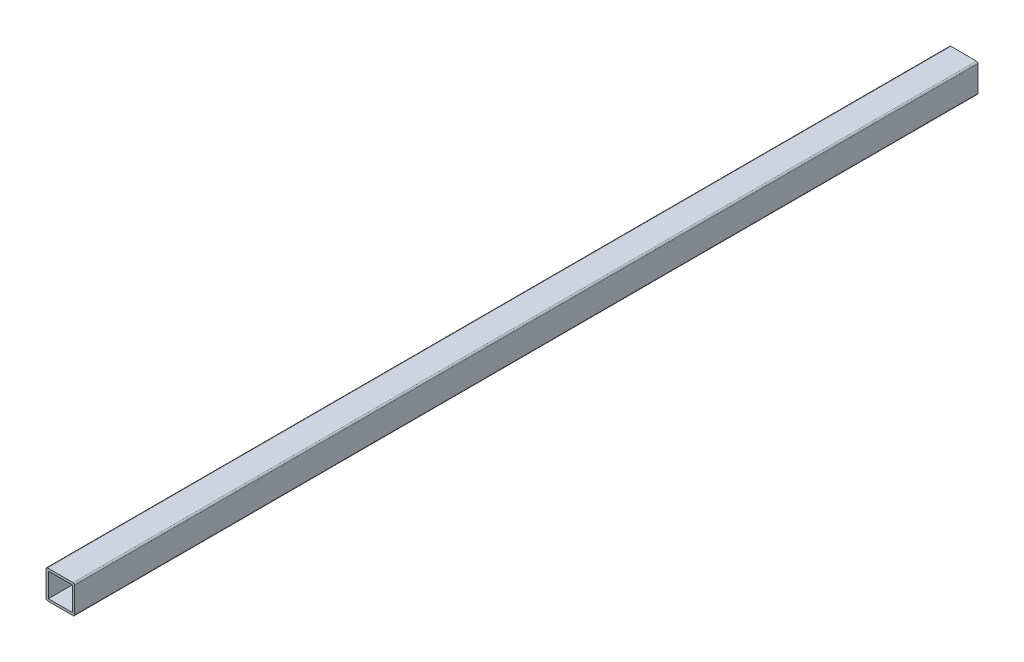
ISO-10303-21;
HEADER;
FILE_DESCRIPTION(('STEP AP214'),'2;1');
FILE_NAME('part.step','',(''),(''),'','','');
FILE_SCHEMA(('AUTOMOTIVE_DESIGN { 1 0 10303 214 1 1 1 1 }'));
ENDSEC;
DATA;
#1=APPLICATION_CONTEXT('core data for automotive mechanical design processes');
#2=APPLICATION_PROTOCOL_DEFINITION('international standard','automotive_design',2000,#1);
#3=PRODUCT_CONTEXT('',#1,'mechanical');
#4=PRODUCT('Part','Part','',(#3));
#5=PRODUCT_RELATED_PRODUCT_CATEGORY('part','',(#4));
#6=PRODUCT_DEFINITION_FORMATION('','',#4);
#7=PRODUCT_DEFINITION_CONTEXT('part definition',#1,'design');
#8=PRODUCT_DEFINITION('design','',#6,#7);
#9=PRODUCT_DEFINITION_SHAPE('','',#8);
#10=(LENGTH_UNIT() NAMED_UNIT(*) SI_UNIT(.MILLI.,.METRE.));
#11=(NAMED_UNIT(*) PLANE_ANGLE_UNIT() SI_UNIT($,.RADIAN.));
#12=(NAMED_UNIT(*) SI_UNIT($,.STERADIAN.) SOLID_ANGLE_UNIT());
#13=UNCERTAINTY_MEASURE_WITH_UNIT(LENGTH_MEASURE(1.E-05),#10,'distance_accuracy_value','');
#14=(GEOMETRIC_REPRESENTATION_CONTEXT(3) GLOBAL_UNCERTAINTY_ASSIGNED_CONTEXT((#13)) GLOBAL_UNIT_ASSIGNED_CONTEXT((#10,
#11,#12)) REPRESENTATION_CONTEXT('',''));
#15=CARTESIAN_POINT('',(0.,0.,0.));
#16=DIRECTION('',(0.,0.,1.));
#17=DIRECTION('',(1.,0.,0.));
#18=AXIS2_PLACEMENT_3D('',#15,#16,#17);
#19=CARTESIAN_POINT('',(0.,0.,600.));
#20=DIRECTION('',(0.,0.,1.));
#21=DIRECTION('',(1.,0.,0.));
#22=AXIS2_PLACEMENT_3D('',#19,#20,#21);
#23=PLANE('',#22);
#24=DIRECTION('',(0.,-1.,0.));
#25=VECTOR('',#24,1.);
#26=CARTESIAN_POINT('',(0.,0.,600.));
#27=LINE('',#26,#25);
#28=CARTESIAN_POINT('',(0.,-1.,600.));
#29=VERTEX_POINT('',#28);
#30=CARTESIAN_POINT('',(0.,-18.,600.));
#31=VERTEX_POINT('',#30);
#32=EDGE_CURVE('E165',#29,#31,#27,.T.);
#33=ORIENTED_EDGE('',*,*,#32,.T.);
#34=CARTESIAN_POINT('',(1.,-18.,600.));
#35=DIRECTION('',(0.,0.,1.));
#36=DIRECTION('',(1.,0.,0.));
#37=AXIS2_PLACEMENT_3D('',#34,#35,#36);
#38=CIRCLE('',#37,1.);
#39=CARTESIAN_POINT('',(1.,-19.,600.));
#40=VERTEX_POINT('',#39);
#41=EDGE_CURVE('E208',#31,#40,#38,.T.);
#42=ORIENTED_EDGE('',*,*,#41,.T.);
#43=DIRECTION('',(1.,0.,0.));
#44=VECTOR('',#43,1.);
#45=CARTESIAN_POINT('',(0.,-19.,600.));
#46=LINE('',#45,#44);
#47=CARTESIAN_POINT('',(18.,-19.,600.));
#48=VERTEX_POINT('',#47);
#49=EDGE_CURVE('E168',#40,#48,#46,.T.);
#50=ORIENTED_EDGE('',*,*,#49,.T.);
#51=CARTESIAN_POINT('',(18.,-18.,600.));
#52=DIRECTION('',(0.,0.,1.));
#53=DIRECTION('',(1.,0.,0.));
#54=AXIS2_PLACEMENT_3D('',#51,#52,#53);
#55=CIRCLE('',#54,1.);
#56=CARTESIAN_POINT('',(19.,-18.,600.));
#57=VERTEX_POINT('',#56);
#58=EDGE_CURVE('E204',#48,#57,#55,.T.);
#59=ORIENTED_EDGE('',*,*,#58,.T.);
#60=DIRECTION('',(0.,1.,0.));
#61=VECTOR('',#60,1.);
#62=CARTESIAN_POINT('',(19.,0.,600.));
#63=LINE('',#62,#61);
#64=CARTESIAN_POINT('',(19.,-1.,600.));
#65=VERTEX_POINT('',#64);
#66=EDGE_CURVE('E172',#57,#65,#63,.T.);
#67=ORIENTED_EDGE('',*,*,#66,.T.);
#68=CARTESIAN_POINT('',(18.,-1.,600.));
#69=DIRECTION('',(0.,0.,1.));
#70=DIRECTION('',(1.,0.,0.));
#71=AXIS2_PLACEMENT_3D('',#68,#69,#70);
#72=CIRCLE('',#71,1.);
#73=CARTESIAN_POINT('',(18.,0.,600.));
#74=VERTEX_POINT('',#73);
#75=EDGE_CURVE('E54',#65,#74,#72,.T.);
#76=ORIENTED_EDGE('',*,*,#75,.T.);
#77=DIRECTION('',(-1.,0.,0.));
#78=VECTOR('',#77,1.);
#79=CARTESIAN_POINT('',(0.,0.,600.));
#80=LINE('',#79,#78);
#81=CARTESIAN_POINT('',(1.,0.,600.));
#82=VERTEX_POINT('',#81);
#83=EDGE_CURVE('E174',#74,#82,#80,.T.);
#84=ORIENTED_EDGE('',*,*,#83,.T.);
#85=CARTESIAN_POINT('',(1.,-1.,600.));
#86=DIRECTION('',(0.,0.,1.));
#87=DIRECTION('',(1.,0.,0.));
#88=AXIS2_PLACEMENT_3D('',#85,#86,#87);
#89=CIRCLE('',#88,1.);
#90=EDGE_CURVE('E206',#82,#29,#89,.T.);
#91=ORIENTED_EDGE('',*,*,#90,.T.);
#92=EDGE_LOOP('',(#33,#42,#50,#59,#67,#76,#84,#91));
#93=FACE_BOUND('',#92,.T.);
#94=DIRECTION('',(1.,0.,0.));
#95=VECTOR('',#94,1.);
#96=CARTESIAN_POINT('',(1.56,-17.44,600.));
#97=LINE('',#96,#95);
#98=CARTESIAN_POINT('',(1.56,-17.44,600.));
#99=VERTEX_POINT('',#98);
#100=CARTESIAN_POINT('',(17.44,-17.44,600.));
#101=VERTEX_POINT('',#100);
#102=EDGE_CURVE('E134',#99,#101,#97,.T.);
#103=ORIENTED_EDGE('',*,*,#102,.F.);
#104=DIRECTION('',(0.,-1.,0.));
#105=VECTOR('',#104,1.);
#106=CARTESIAN_POINT('',(1.56,-1.56,600.));
#107=LINE('',#106,#105);
#108=CARTESIAN_POINT('',(1.56,-1.56,600.));
#109=VERTEX_POINT('',#108);
#110=EDGE_CURVE('E124',#109,#99,#107,.T.);
#111=ORIENTED_EDGE('',*,*,#110,.F.);
#112=DIRECTION('',(-1.,0.,0.));
#113=VECTOR('',#112,1.);
#114=CARTESIAN_POINT('',(1.56,-1.56,600.));
#115=LINE('',#114,#113);
#116=CARTESIAN_POINT('',(17.44,-1.56,600.));
#117=VERTEX_POINT('',#116);
#118=EDGE_CURVE('E149',#117,#109,#115,.T.);
#119=ORIENTED_EDGE('',*,*,#118,.F.);
#120=DIRECTION('',(0.,1.,0.));
#121=VECTOR('',#120,1.);
#122=CARTESIAN_POINT('',(17.44,-1.56,600.));
#123=LINE('',#122,#121);
#124=EDGE_CURVE('E147',#101,#117,#123,.T.);
#125=ORIENTED_EDGE('',*,*,#124,.F.);
#126=EDGE_LOOP('',(#103,#111,#119,#125));
#127=FACE_BOUND('',#126,.T.);
#128=ADVANCED_FACE('F32',(#93,#127),#23,.T.);
#129=CARTESIAN_POINT('',(0.,0.,0.));
#130=DIRECTION('',(0.,0.,1.));
#131=DIRECTION('',(1.,0.,0.));
#132=AXIS2_PLACEMENT_3D('',#129,#130,#131);
#133=PLANE('',#132);
#134=DIRECTION('',(1.,0.,0.));
#135=VECTOR('',#134,1.);
#136=CARTESIAN_POINT('',(0.,-19.,0.));
#137=LINE('',#136,#135);
#138=CARTESIAN_POINT('',(1.,-19.,0.));
#139=VERTEX_POINT('',#138);
#140=CARTESIAN_POINT('',(18.,-19.,0.));
#141=VERTEX_POINT('',#140);
#142=EDGE_CURVE('E179',#139,#141,#137,.T.);
#143=ORIENTED_EDGE('',*,*,#142,.F.);
#144=CARTESIAN_POINT('',(1.,-18.,0.));
#145=DIRECTION('',(0.,0.,1.));
#146=DIRECTION('',(1.,0.,0.));
#147=AXIS2_PLACEMENT_3D('',#144,#145,#146);
#148=CIRCLE('',#147,1.);
#149=CARTESIAN_POINT('',(0.,-18.,0.));
#150=VERTEX_POINT('',#149);
#151=EDGE_CURVE('E196',#139,#150,#148,.F.);
#152=ORIENTED_EDGE('',*,*,#151,.T.);
#153=DIRECTION('',(0.,-1.,0.));
#154=VECTOR('',#153,1.);
#155=CARTESIAN_POINT('',(0.,0.,0.));
#156=LINE('',#155,#154);
#157=CARTESIAN_POINT('',(0.,-1.,0.));
#158=VERTEX_POINT('',#157);
#159=EDGE_CURVE('E142',#158,#150,#156,.T.);
#160=ORIENTED_EDGE('',*,*,#159,.F.);
#161=CARTESIAN_POINT('',(1.,-1.,0.));
#162=DIRECTION('',(0.,0.,1.));
#163=DIRECTION('',(1.,0.,0.));
#164=AXIS2_PLACEMENT_3D('',#161,#162,#163);
#165=CIRCLE('',#164,1.);
#166=CARTESIAN_POINT('',(1.,0.,0.));
#167=VERTEX_POINT('',#166);
#168=EDGE_CURVE('E194',#158,#167,#165,.F.);
#169=ORIENTED_EDGE('',*,*,#168,.T.);
#170=DIRECTION('',(-1.,0.,0.));
#171=VECTOR('',#170,1.);
#172=CARTESIAN_POINT('',(0.,0.,0.));
#173=LINE('',#172,#171);
#174=CARTESIAN_POINT('',(18.,0.,0.));
#175=VERTEX_POINT('',#174);
#176=EDGE_CURVE('E169',#175,#167,#173,.T.);
#177=ORIENTED_EDGE('',*,*,#176,.F.);
#178=CARTESIAN_POINT('',(18.,-1.,0.));
#179=DIRECTION('',(0.,0.,1.));
#180=DIRECTION('',(1.,0.,0.));
#181=AXIS2_PLACEMENT_3D('',#178,#179,#180);
#182=CIRCLE('',#181,1.);
#183=CARTESIAN_POINT('',(19.,-1.,0.));
#184=VERTEX_POINT('',#183);
#185=EDGE_CURVE('E190',#175,#184,#182,.F.);
#186=ORIENTED_EDGE('',*,*,#185,.T.);
#187=DIRECTION('',(0.,1.,0.));
#188=VECTOR('',#187,1.);
#189=CARTESIAN_POINT('',(19.,0.,0.));
#190=LINE('',#189,#188);
#191=CARTESIAN_POINT('',(19.,-18.,0.));
#192=VERTEX_POINT('',#191);
#193=EDGE_CURVE('E182',#192,#184,#190,.T.);
#194=ORIENTED_EDGE('',*,*,#193,.F.);
#195=CARTESIAN_POINT('',(18.,-18.,0.));
#196=DIRECTION('',(0.,0.,1.));
#197=DIRECTION('',(1.,0.,0.));
#198=AXIS2_PLACEMENT_3D('',#195,#196,#197);
#199=CIRCLE('',#198,1.);
#200=EDGE_CURVE('E192',#192,#141,#199,.F.);
#201=ORIENTED_EDGE('',*,*,#200,.T.);
#202=EDGE_LOOP('',(#143,#152,#160,#169,#177,#186,#194,#201));
#203=FACE_BOUND('',#202,.T.);
#204=DIRECTION('',(0.,-1.,0.));
#205=VECTOR('',#204,1.);
#206=CARTESIAN_POINT('',(1.56,-1.56,0.));
#207=LINE('',#206,#205);
#208=CARTESIAN_POINT('',(1.56,-1.56,0.));
#209=VERTEX_POINT('',#208);
#210=CARTESIAN_POINT('',(1.56,-17.44,0.));
#211=VERTEX_POINT('',#210);
#212=EDGE_CURVE('E153',#209,#211,#207,.T.);
#213=ORIENTED_EDGE('',*,*,#212,.T.);
#214=DIRECTION('',(1.,0.,0.));
#215=VECTOR('',#214,1.);
#216=CARTESIAN_POINT('',(1.56,-17.44,0.));
#217=LINE('',#216,#215);
#218=CARTESIAN_POINT('',(17.44,-17.44,0.));
#219=VERTEX_POINT('',#218);
#220=EDGE_CURVE('E141',#211,#219,#217,.T.);
#221=ORIENTED_EDGE('',*,*,#220,.T.);
#222=DIRECTION('',(0.,1.,0.));
#223=VECTOR('',#222,1.);
#224=CARTESIAN_POINT('',(17.44,-1.56,0.));
#225=LINE('',#224,#223);
#226=CARTESIAN_POINT('',(17.44,-1.56,0.));
#227=VERTEX_POINT('',#226);
#228=EDGE_CURVE('E156',#219,#227,#225,.T.);
#229=ORIENTED_EDGE('',*,*,#228,.T.);
#230=DIRECTION('',(-1.,0.,0.));
#231=VECTOR('',#230,1.);
#232=CARTESIAN_POINT('',(1.56,-1.56,0.));
#233=LINE('',#232,#231);
#234=EDGE_CURVE('E135',#227,#209,#233,.T.);
#235=ORIENTED_EDGE('',*,*,#234,.T.);
#236=EDGE_LOOP('',(#213,#221,#229,#235));
#237=FACE_BOUND('',#236,.T.);
#238=ADVANCED_FACE('F226',(#203,#237),#133,.F.);
#239=CARTESIAN_POINT('',(0.,0.,600.));
#240=DIRECTION('',(1.,0.,0.));
#241=DIRECTION('',(0.,1.,0.));
#242=AXIS2_PLACEMENT_3D('',#239,#240,#241);
#243=PLANE('',#242);
#244=ORIENTED_EDGE('',*,*,#159,.T.);
#245=DIRECTION('',(0.,0.,-1.));
#246=VECTOR('',#245,1.);
#247=CARTESIAN_POINT('',(0.,-18.,600.));
#248=LINE('',#247,#246);
#249=EDGE_CURVE('E201',#150,#31,#248,.F.);
#250=ORIENTED_EDGE('',*,*,#249,.T.);
#251=ORIENTED_EDGE('',*,*,#32,.F.);
#252=DIRECTION('',(0.,0.,-1.));
#253=VECTOR('',#252,1.);
#254=CARTESIAN_POINT('',(0.,-1.,600.));
#255=LINE('',#254,#253);
#256=EDGE_CURVE('E198',#29,#158,#255,.T.);
#257=ORIENTED_EDGE('',*,*,#256,.T.);
#258=EDGE_LOOP('',(#244,#250,#251,#257));
#259=FACE_BOUND('',#258,.T.);
#260=ADVANCED_FACE('F235',(#259),#243,.F.);
#261=CARTESIAN_POINT('',(0.,-19.,600.));
#262=DIRECTION('',(0.,1.,0.));
#263=DIRECTION('',(0.,0.,1.));
#264=AXIS2_PLACEMENT_3D('',#261,#262,#263);
#265=PLANE('',#264);
#266=ORIENTED_EDGE('',*,*,#49,.F.);
#267=DIRECTION('',(0.,0.,-1.));
#268=VECTOR('',#267,1.);
#269=CARTESIAN_POINT('',(1.,-19.,600.));
#270=LINE('',#269,#268);
#271=EDGE_CURVE('E187',#40,#139,#270,.T.);
#272=ORIENTED_EDGE('',*,*,#271,.T.);
#273=ORIENTED_EDGE('',*,*,#142,.T.);
#274=DIRECTION('',(0.,0.,-1.));
#275=VECTOR('',#274,1.);
#276=CARTESIAN_POINT('',(18.,-19.,600.));
#277=LINE('',#276,#275);
#278=EDGE_CURVE('E176',#141,#48,#277,.F.);
#279=ORIENTED_EDGE('',*,*,#278,.T.);
#280=EDGE_LOOP('',(#266,#272,#273,#279));
#281=FACE_BOUND('',#280,.T.);
#282=ADVANCED_FACE('F243',(#281),#265,.F.);
#283=CARTESIAN_POINT('',(19.,0.,600.));
#284=DIRECTION('',(-1.,0.,0.));
#285=DIRECTION('',(0.,0.,1.));
#286=AXIS2_PLACEMENT_3D('',#283,#284,#285);
#287=PLANE('',#286);
#288=ORIENTED_EDGE('',*,*,#66,.F.);
#289=DIRECTION('',(0.,0.,-1.));
#290=VECTOR('',#289,1.);
#291=CARTESIAN_POINT('',(19.,-18.,600.));
#292=LINE('',#291,#290);
#293=EDGE_CURVE('E11',#57,#192,#292,.T.);
#294=ORIENTED_EDGE('',*,*,#293,.T.);
#295=ORIENTED_EDGE('',*,*,#193,.T.);
#296=DIRECTION('',(0.,0.,-1.));
#297=VECTOR('',#296,1.);
#298=CARTESIAN_POINT('',(19.,-1.,600.));
#299=LINE('',#298,#297);
#300=EDGE_CURVE('E40',#184,#65,#299,.F.);
#301=ORIENTED_EDGE('',*,*,#300,.T.);
#302=EDGE_LOOP('',(#288,#294,#295,#301));
#303=FACE_BOUND('',#302,.T.);
#304=ADVANCED_FACE('F216',(#303),#287,.F.);
#305=CARTESIAN_POINT('',(0.,0.,600.));
#306=DIRECTION('',(0.,-1.,0.));
#307=DIRECTION('',(0.,0.,-1.));
#308=AXIS2_PLACEMENT_3D('',#305,#306,#307);
#309=PLANE('',#308);
#310=ORIENTED_EDGE('',*,*,#176,.T.);
#311=DIRECTION('',(0.,0.,-1.));
#312=VECTOR('',#311,1.);
#313=CARTESIAN_POINT('',(1.,0.,600.));
#314=LINE('',#313,#312);
#315=EDGE_CURVE('E47',#167,#82,#314,.F.);
#316=ORIENTED_EDGE('',*,*,#315,.T.);
#317=ORIENTED_EDGE('',*,*,#83,.F.);
#318=DIRECTION('',(0.,0.,-1.));
#319=VECTOR('',#318,1.);
#320=CARTESIAN_POINT('',(18.,0.,600.));
#321=LINE('',#320,#319);
#322=EDGE_CURVE('E210',#74,#175,#321,.T.);
#323=ORIENTED_EDGE('',*,*,#322,.T.);
#324=EDGE_LOOP('',(#310,#316,#317,#323));
#325=FACE_BOUND('',#324,.T.);
#326=ADVANCED_FACE('F223',(#325),#309,.F.);
#327=CARTESIAN_POINT('',(1.56,-1.56,600.));
#328=DIRECTION('',(1.,0.,0.));
#329=DIRECTION('',(0.,1.,0.));
#330=AXIS2_PLACEMENT_3D('',#327,#328,#329);
#331=PLANE('',#330);
#332=ORIENTED_EDGE('',*,*,#212,.F.);
#333=DIRECTION('',(0.,0.,-1.));
#334=VECTOR('',#333,1.);
#335=CARTESIAN_POINT('',(1.56,-1.56,600.));
#336=LINE('',#335,#334);
#337=EDGE_CURVE('E130',#109,#209,#336,.T.);
#338=ORIENTED_EDGE('',*,*,#337,.F.);
#339=ORIENTED_EDGE('',*,*,#110,.T.);
#340=DIRECTION('',(0.,0.,-1.));
#341=VECTOR('',#340,1.);
#342=CARTESIAN_POINT('',(1.56,-17.44,600.));
#343=LINE('',#342,#341);
#344=EDGE_CURVE('E127',#99,#211,#343,.T.);
#345=ORIENTED_EDGE('',*,*,#344,.T.);
#346=EDGE_LOOP('',(#332,#338,#339,#345));
#347=FACE_BOUND('',#346,.T.);
#348=ADVANCED_FACE('F126',(#347),#331,.T.);
#349=CARTESIAN_POINT('',(1.56,-17.44,600.));
#350=DIRECTION('',(0.,1.,0.));
#351=DIRECTION('',(0.,0.,1.));
#352=AXIS2_PLACEMENT_3D('',#349,#350,#351);
#353=PLANE('',#352);
#354=ORIENTED_EDGE('',*,*,#220,.F.);
#355=ORIENTED_EDGE('',*,*,#344,.F.);
#356=ORIENTED_EDGE('',*,*,#102,.T.);
#357=DIRECTION('',(0.,0.,-1.));
#358=VECTOR('',#357,1.);
#359=CARTESIAN_POINT('',(17.44,-17.44,600.));
#360=LINE('',#359,#358);
#361=EDGE_CURVE('E143',#101,#219,#360,.T.);
#362=ORIENTED_EDGE('',*,*,#361,.T.);
#363=EDGE_LOOP('',(#354,#355,#356,#362));
#364=FACE_BOUND('',#363,.T.);
#365=ADVANCED_FACE('F138',(#364),#353,.T.);
#366=CARTESIAN_POINT('',(17.44,-1.56,600.));
#367=DIRECTION('',(-1.,0.,0.));
#368=DIRECTION('',(0.,-1.,0.));
#369=AXIS2_PLACEMENT_3D('',#366,#367,#368);
#370=PLANE('',#369);
#371=ORIENTED_EDGE('',*,*,#228,.F.);
#372=ORIENTED_EDGE('',*,*,#361,.F.);
#373=ORIENTED_EDGE('',*,*,#124,.T.);
#374=DIRECTION('',(0.,0.,-1.));
#375=VECTOR('',#374,1.);
#376=CARTESIAN_POINT('',(17.44,-1.56,600.));
#377=LINE('',#376,#375);
#378=EDGE_CURVE('E162',#117,#227,#377,.T.);
#379=ORIENTED_EDGE('',*,*,#378,.T.);
#380=EDGE_LOOP('',(#371,#372,#373,#379));
#381=FACE_BOUND('',#380,.T.);
#382=ADVANCED_FACE('F275',(#381),#370,.T.);
#383=CARTESIAN_POINT('',(1.56,-1.56,600.));
#384=DIRECTION('',(0.,-1.,0.));
#385=DIRECTION('',(0.,0.,-1.));
#386=AXIS2_PLACEMENT_3D('',#383,#384,#385);
#387=PLANE('',#386);
#388=ORIENTED_EDGE('',*,*,#234,.F.);
#389=ORIENTED_EDGE('',*,*,#378,.F.);
#390=ORIENTED_EDGE('',*,*,#118,.T.);
#391=ORIENTED_EDGE('',*,*,#337,.T.);
#392=EDGE_LOOP('',(#388,#389,#390,#391));
#393=FACE_BOUND('',#392,.T.);
#394=ADVANCED_FACE('F271',(#393),#387,.T.);
#395=CARTESIAN_POINT('',(1.,-18.,600.));
#396=DIRECTION('',(0.,0.,-1.));
#397=DIRECTION('',(-1.,0.,0.));
#398=AXIS2_PLACEMENT_3D('',#395,#396,#397);
#399=CYLINDRICAL_SURFACE('',#398,1.);
#400=ORIENTED_EDGE('',*,*,#41,.F.);
#401=ORIENTED_EDGE('',*,*,#249,.F.);
#402=ORIENTED_EDGE('',*,*,#151,.F.);
#403=ORIENTED_EDGE('',*,*,#271,.F.);
#404=EDGE_LOOP('',(#400,#401,#402,#403));
#405=FACE_BOUND('',#404,.T.);
#406=ADVANCED_FACE('F241',(#405),#399,.T.);
#407=CARTESIAN_POINT('',(1.,-1.,600.));
#408=DIRECTION('',(0.,0.,-1.));
#409=DIRECTION('',(-1.,0.,0.));
#410=AXIS2_PLACEMENT_3D('',#407,#408,#409);
#411=CYLINDRICAL_SURFACE('',#410,1.);
#412=ORIENTED_EDGE('',*,*,#90,.F.);
#413=ORIENTED_EDGE('',*,*,#315,.F.);
#414=ORIENTED_EDGE('',*,*,#168,.F.);
#415=ORIENTED_EDGE('',*,*,#256,.F.);
#416=EDGE_LOOP('',(#412,#413,#414,#415));
#417=FACE_BOUND('',#416,.T.);
#418=ADVANCED_FACE('F232',(#417),#411,.T.);
#419=CARTESIAN_POINT('',(18.,-18.,600.));
#420=DIRECTION('',(0.,0.,-1.));
#421=DIRECTION('',(-1.,0.,0.));
#422=AXIS2_PLACEMENT_3D('',#419,#420,#421);
#423=CYLINDRICAL_SURFACE('',#422,1.);
#424=ORIENTED_EDGE('',*,*,#58,.F.);
#425=ORIENTED_EDGE('',*,*,#278,.F.);
#426=ORIENTED_EDGE('',*,*,#200,.F.);
#427=ORIENTED_EDGE('',*,*,#293,.F.);
#428=EDGE_LOOP('',(#424,#425,#426,#427));
#429=FACE_BOUND('',#428,.T.);
#430=ADVANCED_FACE('F246',(#429),#423,.T.);
#431=CARTESIAN_POINT('',(18.,-1.,600.));
#432=DIRECTION('',(0.,0.,-1.));
#433=DIRECTION('',(-1.,0.,0.));
#434=AXIS2_PLACEMENT_3D('',#431,#432,#433);
#435=CYLINDRICAL_SURFACE('',#434,1.);
#436=ORIENTED_EDGE('',*,*,#75,.F.);
#437=ORIENTED_EDGE('',*,*,#300,.F.);
#438=ORIENTED_EDGE('',*,*,#185,.F.);
#439=ORIENTED_EDGE('',*,*,#322,.F.);
#440=EDGE_LOOP('',(#436,#437,#438,#439));
#441=FACE_BOUND('',#440,.T.);
#442=ADVANCED_FACE('F34',(#441),#435,.T.);
#443=CLOSED_SHELL('',(#128,#238,#260,#282,#304,#326,#348,#365,#382,#394,#406,#418,#430,#442));
#444=MANIFOLD_SOLID_BREP('B2',#443);
#445=ADVANCED_BREP_SHAPE_REPRESENTATION('',(#18,#444),#14);
#446=SHAPE_DEFINITION_REPRESENTATION(#9,#445);
ENDSEC;
END-ISO-10303-21;
